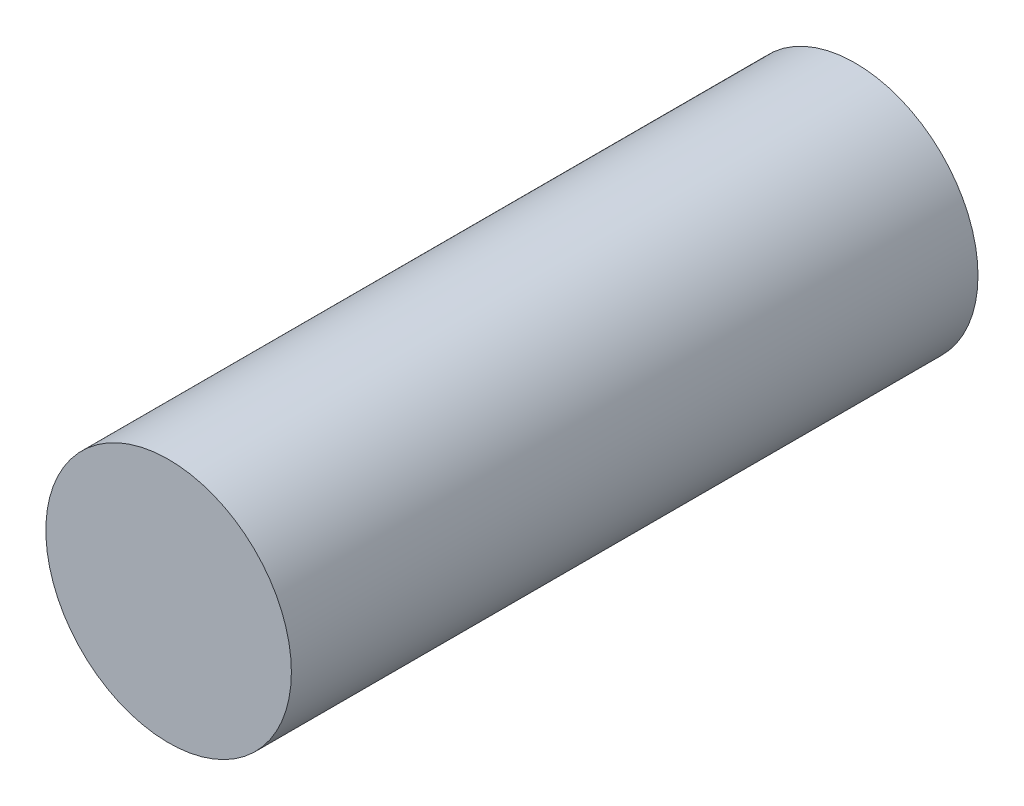
ISO-10303-21;
HEADER;
FILE_DESCRIPTION(('STEP AP214'),'2;1');
FILE_NAME('part.step','',(''),(''),'','','');
FILE_SCHEMA(('AUTOMOTIVE_DESIGN { 1 0 10303 214 1 1 1 1 }'));
ENDSEC;
DATA;
#1=APPLICATION_CONTEXT('core data for automotive mechanical design processes');
#2=APPLICATION_PROTOCOL_DEFINITION('international standard','automotive_design',2000,#1);
#3=PRODUCT_CONTEXT('',#1,'mechanical');
#4=PRODUCT('Part','Part','',(#3));
#5=PRODUCT_RELATED_PRODUCT_CATEGORY('part','',(#4));
#6=PRODUCT_DEFINITION_FORMATION('','',#4);
#7=PRODUCT_DEFINITION_CONTEXT('part definition',#1,'design');
#8=PRODUCT_DEFINITION('design','',#6,#7);
#9=PRODUCT_DEFINITION_SHAPE('','',#8);
#10=(LENGTH_UNIT() NAMED_UNIT(*) SI_UNIT(.MILLI.,.METRE.));
#11=(NAMED_UNIT(*) PLANE_ANGLE_UNIT() SI_UNIT($,.RADIAN.));
#12=(NAMED_UNIT(*) SI_UNIT($,.STERADIAN.) SOLID_ANGLE_UNIT());
#13=UNCERTAINTY_MEASURE_WITH_UNIT(LENGTH_MEASURE(1.E-05),#10,'distance_accuracy_value','');
#14=(GEOMETRIC_REPRESENTATION_CONTEXT(3) GLOBAL_UNCERTAINTY_ASSIGNED_CONTEXT((#13)) GLOBAL_UNIT_ASSIGNED_CONTEXT((#10,
#11,#12)) REPRESENTATION_CONTEXT('',''));
#15=CARTESIAN_POINT('',(0.,0.,0.));
#16=DIRECTION('',(0.,0.,1.));
#17=DIRECTION('',(1.,0.,0.));
#18=AXIS2_PLACEMENT_3D('',#15,#16,#17);
#19=CARTESIAN_POINT('',(0.,0.,33.3));
#20=DIRECTION('',(0.,0.,1.));
#21=DIRECTION('',(1.,0.,0.));
#22=AXIS2_PLACEMENT_3D('',#19,#20,#21);
#23=PLANE('',#22);
#24=CARTESIAN_POINT('',(0.,0.,33.3));
#25=DIRECTION('',(0.,0.,1.));
#26=DIRECTION('',(1.,0.,0.));
#27=AXIS2_PLACEMENT_3D('',#24,#25,#26);
#28=CIRCLE('',#27,5.775);
#29=CARTESIAN_POINT('',(5.775,0.,33.3));
#30=VERTEX_POINT('',#29);
#31=EDGE_CURVE('E18',#30,#30,#28,.F.);
#32=ORIENTED_EDGE('',*,*,#31,.F.);
#33=EDGE_LOOP('',(#32));
#34=FACE_BOUND('',#33,.T.);
#35=ADVANCED_FACE('F15',(#34),#23,.T.);
#36=CARTESIAN_POINT('',(0.,0.,1.));
#37=DIRECTION('',(0.,0.,1.));
#38=DIRECTION('',(1.,0.,0.));
#39=AXIS2_PLACEMENT_3D('',#36,#37,#38);
#40=PLANE('',#39);
#41=CARTESIAN_POINT('',(0.,0.,1.));
#42=DIRECTION('',(0.,0.,1.));
#43=DIRECTION('',(1.,0.,0.));
#44=AXIS2_PLACEMENT_3D('',#41,#42,#43);
#45=CIRCLE('',#44,5.775);
#46=CARTESIAN_POINT('',(5.775,0.,1.));
#47=VERTEX_POINT('',#46);
#48=EDGE_CURVE('E10',#47,#47,#45,.T.);
#49=ORIENTED_EDGE('',*,*,#48,.F.);
#50=EDGE_LOOP('',(#49));
#51=FACE_BOUND('',#50,.T.);
#52=ADVANCED_FACE('F30',(#51),#40,.F.);
#53=CARTESIAN_POINT('',(0.,0.,1.));
#54=DIRECTION('',(0.,0.,1.));
#55=DIRECTION('',(1.,0.,0.));
#56=AXIS2_PLACEMENT_3D('',#53,#54,#55);
#57=CYLINDRICAL_SURFACE('',#56,5.775);
#58=ORIENTED_EDGE('',*,*,#48,.T.);
#59=EDGE_LOOP('',(#58));
#60=FACE_BOUND('',#59,.T.);
#61=ORIENTED_EDGE('',*,*,#31,.T.);
#62=EDGE_LOOP('',(#61));
#63=FACE_BOUND('',#62,.T.);
#64=ADVANCED_FACE('F27',(#60,#63),#57,.T.);
#65=CLOSED_SHELL('',(#35,#52,#64));
#66=MANIFOLD_SOLID_BREP('B1',#65);
#67=ADVANCED_BREP_SHAPE_REPRESENTATION('',(#18,#66),#14);
#68=SHAPE_DEFINITION_REPRESENTATION(#9,#67);
ENDSEC;
END-ISO-10303-21;
